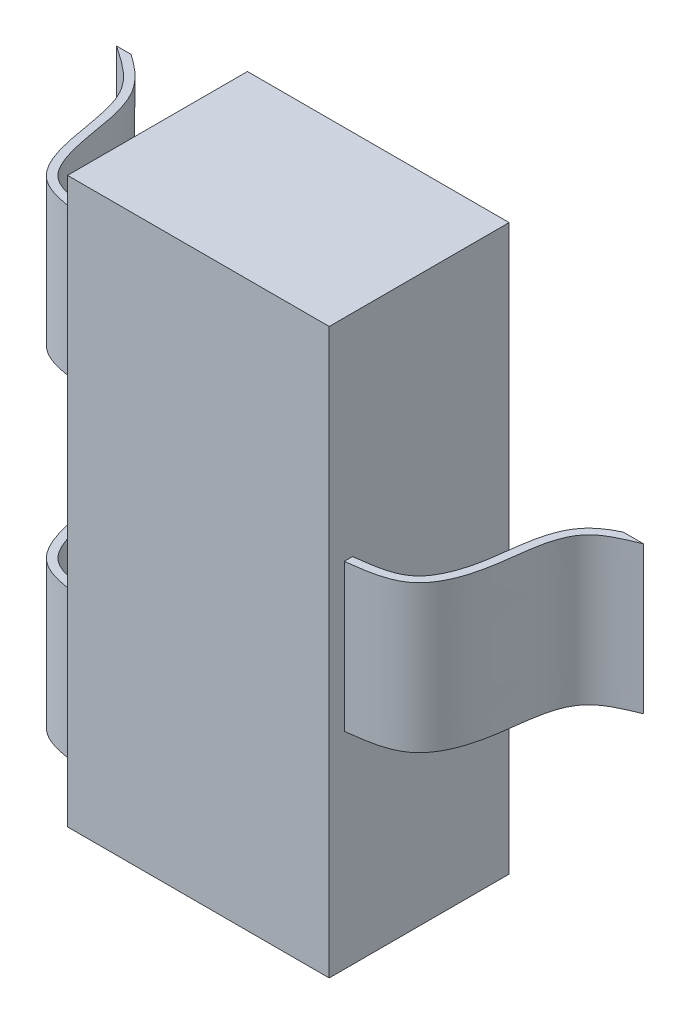
ISO-10303-21;
HEADER;
FILE_DESCRIPTION(('STEP AP214'),'2;1');
FILE_NAME('part.step','',(''),(''),'','','');
FILE_SCHEMA(('AUTOMOTIVE_DESIGN { 1 0 10303 214 1 1 1 1 }'));
ENDSEC;
DATA;
#1=APPLICATION_CONTEXT('core data for automotive mechanical design processes');
#2=APPLICATION_PROTOCOL_DEFINITION('international standard','automotive_design',2000,#1);
#3=PRODUCT_CONTEXT('',#1,'mechanical');
#4=PRODUCT('Part','Part','',(#3));
#5=PRODUCT_RELATED_PRODUCT_CATEGORY('part','',(#4));
#6=PRODUCT_DEFINITION_FORMATION('','',#4);
#7=PRODUCT_DEFINITION_CONTEXT('part definition',#1,'design');
#8=PRODUCT_DEFINITION('design','',#6,#7);
#9=PRODUCT_DEFINITION_SHAPE('','',#8);
#10=(LENGTH_UNIT() NAMED_UNIT(*) SI_UNIT(.MILLI.,.METRE.));
#11=(NAMED_UNIT(*) PLANE_ANGLE_UNIT() SI_UNIT($,.RADIAN.));
#12=(NAMED_UNIT(*) SI_UNIT($,.STERADIAN.) SOLID_ANGLE_UNIT());
#13=UNCERTAINTY_MEASURE_WITH_UNIT(LENGTH_MEASURE(1.E-05),#10,'distance_accuracy_value','');
#14=(GEOMETRIC_REPRESENTATION_CONTEXT(3) GLOBAL_UNCERTAINTY_ASSIGNED_CONTEXT((#13)) GLOBAL_UNIT_ASSIGNED_CONTEXT((#10,
#11,#12)) REPRESENTATION_CONTEXT('',''));
#15=CARTESIAN_POINT('',(0.,0.,0.));
#16=DIRECTION('',(0.,0.,1.));
#17=DIRECTION('',(1.,0.,0.));
#18=AXIS2_PLACEMENT_3D('',#15,#16,#17);
#19=CARTESIAN_POINT('',(-0.875,-1.71,0.));
#20=DIRECTION('',(0.,0.,1.));
#21=DIRECTION('',(1.,0.,0.));
#22=AXIS2_PLACEMENT_3D('',#19,#20,#21);
#23=PLANE('',#22);
#24=DIRECTION('',(-1.,0.,0.));
#25=VECTOR('',#24,1.);
#26=CARTESIAN_POINT('',(-0.875,-0.55,0.));
#27=LINE('',#26,#25);
#28=CARTESIAN_POINT('',(-1.58641629688414,-0.55,0.));
#29=VERTEX_POINT('',#28);
#30=CARTESIAN_POINT('',(-1.675,-0.55,0.));
#31=VERTEX_POINT('',#30);
#32=EDGE_CURVE('E172',#29,#31,#27,.T.);
#33=ORIENTED_EDGE('',*,*,#32,.F.);
#34=DIRECTION('',(0.,-1.,0.));
#35=VECTOR('',#34,1.);
#36=CARTESIAN_POINT('',(-1.58641629688414,1.74,0.));
#37=LINE('',#36,#35);
#38=CARTESIAN_POINT('',(-1.58641629688414,-1.45,0.));
#39=VERTEX_POINT('',#38);
#40=EDGE_CURVE('E156',#29,#39,#37,.T.);
#41=ORIENTED_EDGE('',*,*,#40,.T.);
#42=DIRECTION('',(1.,0.,0.));
#43=VECTOR('',#42,1.);
#44=CARTESIAN_POINT('',(-1.675,-1.45,0.));
#45=LINE('',#44,#43);
#46=CARTESIAN_POINT('',(-1.675,-1.45,0.));
#47=VERTEX_POINT('',#46);
#48=EDGE_CURVE('E171',#47,#39,#45,.T.);
#49=ORIENTED_EDGE('',*,*,#48,.F.);
#50=DIRECTION('',(0.,-1.,0.));
#51=VECTOR('',#50,1.);
#52=CARTESIAN_POINT('',(-1.675,-0.55,0.));
#53=LINE('',#52,#51);
#54=EDGE_CURVE('E179',#31,#47,#53,.T.);
#55=ORIENTED_EDGE('',*,*,#54,.F.);
#56=EDGE_LOOP('',(#33,#41,#49,#55));
#57=FACE_BOUND('',#56,.T.);
#58=ADVANCED_FACE('F36',(#57),#23,.F.);
#59=DIRECTION('',(-1.,0.,0.));
#60=VECTOR('',#59,1.);
#61=CARTESIAN_POINT('',(-0.875,1.475,0.));
#62=LINE('',#61,#60);
#63=CARTESIAN_POINT('',(-1.58641629688414,1.475,0.));
#64=VERTEX_POINT('',#63);
#65=CARTESIAN_POINT('',(-1.675,1.475,0.));
#66=VERTEX_POINT('',#65);
#67=EDGE_CURVE('E40',#64,#66,#62,.T.);
#68=ORIENTED_EDGE('',*,*,#67,.F.);
#69=CARTESIAN_POINT('',(-1.58641629688414,0.575,0.));
#70=VERTEX_POINT('',#69);
#71=EDGE_CURVE('E173',#64,#70,#37,.T.);
#72=ORIENTED_EDGE('',*,*,#71,.T.);
#73=DIRECTION('',(1.,0.,0.));
#74=VECTOR('',#73,1.);
#75=CARTESIAN_POINT('',(-1.675,0.575,0.));
#76=LINE('',#75,#74);
#77=CARTESIAN_POINT('',(-1.675,0.575000000000001,0.));
#78=VERTEX_POINT('',#77);
#79=EDGE_CURVE('E230',#78,#70,#76,.T.);
#80=ORIENTED_EDGE('',*,*,#79,.F.);
#81=DIRECTION('',(0.,-1.,0.));
#82=VECTOR('',#81,1.);
#83=CARTESIAN_POINT('',(-1.675,1.475,0.));
#84=LINE('',#83,#82);
#85=EDGE_CURVE('E228',#66,#78,#84,.T.);
#86=ORIENTED_EDGE('',*,*,#85,.F.);
#87=EDGE_LOOP('',(#68,#72,#80,#86));
#88=FACE_BOUND('',#87,.T.);
#89=ADVANCED_FACE('F300',(#88),#23,.F.);
#90=DIRECTION('',(1.,0.,0.));
#91=VECTOR('',#90,1.);
#92=CARTESIAN_POINT('',(-0.875,-1.71,0.));
#93=LINE('',#92,#91);
#94=CARTESIAN_POINT('',(-0.875,-1.71,0.));
#95=VERTEX_POINT('',#94);
#96=CARTESIAN_POINT('',(0.725,-1.71,0.));
#97=VERTEX_POINT('',#96);
#98=EDGE_CURVE('E259',#95,#97,#93,.T.);
#99=ORIENTED_EDGE('',*,*,#98,.F.);
#100=DIRECTION('',(0.,-1.,0.));
#101=VECTOR('',#100,1.);
#102=CARTESIAN_POINT('',(-0.875,0.575,0.));
#103=LINE('',#102,#101);
#104=CARTESIAN_POINT('',(-0.875,1.74,0.));
#105=VERTEX_POINT('',#104);
#106=EDGE_CURVE('E192',#105,#95,#103,.T.);
#107=ORIENTED_EDGE('',*,*,#106,.F.);
#108=DIRECTION('',(-1.,0.,0.));
#109=VECTOR('',#108,1.);
#110=CARTESIAN_POINT('',(0.725,1.74,0.));
#111=LINE('',#110,#109);
#112=CARTESIAN_POINT('',(0.725,1.74,0.));
#113=VERTEX_POINT('',#112);
#114=EDGE_CURVE('E283',#113,#105,#111,.T.);
#115=ORIENTED_EDGE('',*,*,#114,.F.);
#116=DIRECTION('',(0.,1.,0.));
#117=VECTOR('',#116,1.);
#118=CARTESIAN_POINT('',(0.725,0.45,0.));
#119=LINE('',#118,#117);
#120=EDGE_CURVE('E265',#97,#113,#119,.T.);
#121=ORIENTED_EDGE('',*,*,#120,.F.);
#122=EDGE_LOOP('',(#99,#107,#115,#121));
#123=FACE_BOUND('',#122,.T.);
#124=ADVANCED_FACE('F264',(#123),#23,.F.);
#125=CARTESIAN_POINT('',(-0.875,-1.71,1.1));
#126=DIRECTION('',(0.,1.,0.));
#127=DIRECTION('',(0.,0.,1.));
#128=AXIS2_PLACEMENT_3D('',#125,#126,#127);
#129=PLANE('',#128);
#130=ORIENTED_EDGE('',*,*,#98,.T.);
#131=DIRECTION('',(0.,0.,-1.));
#132=VECTOR('',#131,1.);
#133=CARTESIAN_POINT('',(0.725,-1.71,1.1));
#134=LINE('',#133,#132);
#135=CARTESIAN_POINT('',(0.725,-1.71,1.1));
#136=VERTEX_POINT('',#135);
#137=EDGE_CURVE('E249',#136,#97,#134,.T.);
#138=ORIENTED_EDGE('',*,*,#137,.F.);
#139=DIRECTION('',(1.,0.,0.));
#140=VECTOR('',#139,1.);
#141=CARTESIAN_POINT('',(-0.875,-1.71,1.1));
#142=LINE('',#141,#140);
#143=CARTESIAN_POINT('',(-0.875,-1.71,1.1));
#144=VERTEX_POINT('',#143);
#145=EDGE_CURVE('E181',#144,#136,#142,.T.);
#146=ORIENTED_EDGE('',*,*,#145,.F.);
#147=DIRECTION('',(0.,0.,-1.));
#148=VECTOR('',#147,1.);
#149=CARTESIAN_POINT('',(-0.875,-1.71,1.1));
#150=LINE('',#149,#148);
#151=EDGE_CURVE('E46',#144,#95,#150,.T.);
#152=ORIENTED_EDGE('',*,*,#151,.T.);
#153=EDGE_LOOP('',(#130,#138,#146,#152));
#154=FACE_BOUND('',#153,.T.);
#155=ADVANCED_FACE('F38',(#154),#129,.F.);
#156=CARTESIAN_POINT('',(0.725,-0.45,1.1));
#157=DIRECTION('',(0.,1.,0.));
#158=DIRECTION('',(0.,0.,1.));
#159=AXIS2_PLACEMENT_3D('',#156,#157,#158);
#160=PLANE('',#159);
#161=DIRECTION('',(0.,0.,-1.));
#162=VECTOR('',#161,1.);
#163=CARTESIAN_POINT('',(0.725,-0.45,1.1));
#164=LINE('',#163,#162);
#165=CARTESIAN_POINT('',(0.725,-0.449999999999999,1.00768400816071));
#166=VERTEX_POINT('',#165);
#167=CARTESIAN_POINT('',(0.724999999999962,-0.449999999999998,0.957298468849378));
#168=VERTEX_POINT('',#167);
#169=EDGE_CURVE('E243',#166,#168,#164,.T.);
#170=ORIENTED_EDGE('',*,*,#169,.T.);
#171=CARTESIAN_POINT('',(1.528622086414,-0.449999999999999,-0.0462992913405748));
#172=CARTESIAN_POINT('',(1.46986156604953,-0.449999999999999,-0.022340479151652));
#173=CARTESIAN_POINT('',(1.40845247297387,-0.449999999999999,0.00223861783664871));
#174=CARTESIAN_POINT('',(1.32736440376303,-0.449999999999999,0.0554605986947523));
#175=CARTESIAN_POINT('',(1.30188751089638,-0.449999999999999,0.0765675974779763));
#176=CARTESIAN_POINT('',(1.25991048910309,-0.449999999999999,0.125534473454191));
#177=CARTESIAN_POINT('',(1.24339485454769,-0.449999999999999,0.152637932673938));
#178=CARTESIAN_POINT('',(1.17761069445625,-0.449999999999999,0.294933575013133));
#179=CARTESIAN_POINT('',(1.17427129447097,-0.449999999999999,0.42968310509716));
#180=CARTESIAN_POINT('',(1.13407982124533,-0.449999999999999,0.680245939024234));
#181=CARTESIAN_POINT('',(1.09363357899894,-0.449999999999999,0.798176416242423));
#182=CARTESIAN_POINT('',(0.992225356223103,-0.449999999999999,0.893756480555563));
#183=CARTESIAN_POINT('',(0.949632551680684,-0.449999999999999,0.913640338616297));
#184=CARTESIAN_POINT('',(0.843728829002255,-0.449999999999999,0.942335491885586));
#185=CARTESIAN_POINT('',(0.78232096922687,-0.449999999999999,0.950175780395145));
#186=CARTESIAN_POINT('',(0.718833656360517,-0.449999999999999,0.958065703009088));
#187=B_SPLINE_CURVE_WITH_KNOTS('',3,(#171,#172,#173,#174,#175,#176,#177,#178,#179,#180,#181,
#182,#183,#184,#185,#186),.UNSPECIFIED.,.F.,.F.,(4,2,2,2,2,2,2,4),(0.,0.125,0.1875,0.25,0.5,
0.750000000000001,0.875,1.),.UNSPECIFIED.);
#188=CARTESIAN_POINT('',(1.42157256783221,-0.449999999999998,0.));
#189=VERTEX_POINT('',#188);
#190=EDGE_CURVE('E625',#168,#189,#187,.F.);
#191=ORIENTED_EDGE('',*,*,#190,.T.);
#192=DIRECTION('',(1.,0.,0.));
#193=VECTOR('',#192,1.);
#194=CARTESIAN_POINT('',(0.725,-0.45,0.));
#195=LINE('',#194,#193);
#196=CARTESIAN_POINT('',(1.5475,-0.45,0.));
#197=VERTEX_POINT('',#196);
#198=EDGE_CURVE('E266',#189,#197,#195,.T.);
#199=ORIENTED_EDGE('',*,*,#198,.T.);
#200=CARTESIAN_POINT('',(0.725,-0.449999999999999,1.00768400816071));
#201=CARTESIAN_POINT('',(0.841255765887461,-0.449999999999999,0.993236255454474));
#202=CARTESIAN_POINT('',(1.07443441938041,-0.449999999999999,0.964257843103717));
#203=CARTESIAN_POINT('',(1.24069724731398,-0.449999999999999,0.566279230900491));
#204=CARTESIAN_POINT('',(1.212102737147,-0.449999999999999,0.136753724771851));
#205=CARTESIAN_POINT('',(1.46636899253886,-0.449999999999999,0.0330800775487122));
#206=CARTESIAN_POINT('',(1.5475,-0.449999999999999,0.));
#207=B_SPLINE_CURVE_WITH_KNOTS('',3,(#200,#201,#202,#203,#204,#205,#206),.UNSPECIFIED.,.F.,.F.,
(4,1,1,1,4),(0.,0.228895665603673,0.459104825368433,0.827411740574484,1.),.UNSPECIFIED.);
#208=EDGE_CURVE('E648',#197,#166,#207,.F.);
#209=ORIENTED_EDGE('',*,*,#208,.T.);
#210=EDGE_LOOP('',(#170,#191,#199,#209));
#211=FACE_BOUND('',#210,.T.);
#212=ADVANCED_FACE('F374',(#211),#160,.F.);
#213=CARTESIAN_POINT('',(1.5475,0.45,1.1));
#214=DIRECTION('',(0.,-1.,0.));
#215=DIRECTION('',(0.,0.,-1.));
#216=AXIS2_PLACEMENT_3D('',#213,#214,#215);
#217=PLANE('',#216);
#218=DIRECTION('',(-1.,0.,0.));
#219=VECTOR('',#218,1.);
#220=CARTESIAN_POINT('',(1.5475,0.45,0.));
#221=LINE('',#220,#219);
#222=CARTESIAN_POINT('',(1.5475,0.450000000000001,0.));
#223=VERTEX_POINT('',#222);
#224=CARTESIAN_POINT('',(1.42157256783223,0.45,0.));
#225=VERTEX_POINT('',#224);
#226=EDGE_CURVE('E280',#223,#225,#221,.T.);
#227=ORIENTED_EDGE('',*,*,#226,.T.);
#228=CARTESIAN_POINT('',(1.528622086414,0.450000000000001,-0.0462992913405748));
#229=CARTESIAN_POINT('',(1.46986156604953,0.450000000000001,-0.022340479151652));
#230=CARTESIAN_POINT('',(1.40845247297387,0.450000000000001,0.00223861783664871));
#231=CARTESIAN_POINT('',(1.32736440376303,0.450000000000001,0.0554605986947523));
#232=CARTESIAN_POINT('',(1.30188751089638,0.450000000000001,0.0765675974779763));
#233=CARTESIAN_POINT('',(1.25991048910309,0.450000000000001,0.125534473454191));
#234=CARTESIAN_POINT('',(1.24339485454769,0.450000000000001,0.152637932673938));
#235=CARTESIAN_POINT('',(1.17761069445625,0.450000000000001,0.294933575013133));
#236=CARTESIAN_POINT('',(1.17427129447097,0.450000000000001,0.42968310509716));
#237=CARTESIAN_POINT('',(1.13407982124533,0.450000000000001,0.680245939024234));
#238=CARTESIAN_POINT('',(1.09363357899894,0.450000000000001,0.798176416242423));
#239=CARTESIAN_POINT('',(0.992225356223103,0.450000000000001,0.893756480555563));
#240=CARTESIAN_POINT('',(0.949632551680684,0.450000000000001,0.913640338616297));
#241=CARTESIAN_POINT('',(0.843728829002255,0.450000000000001,0.942335491885586));
#242=CARTESIAN_POINT('',(0.78232096922687,0.450000000000001,0.950175780395145));
#243=CARTESIAN_POINT('',(0.718833656360517,0.450000000000001,0.958065703009088));
#244=B_SPLINE_CURVE_WITH_KNOTS('',3,(#228,#229,#230,#231,#232,#233,#234,#235,#236,#237,#238,
#239,#240,#241,#242,#243),.UNSPECIFIED.,.F.,.F.,(4,2,2,2,2,2,2,4),(0.,0.125,0.1875,0.25,0.5,
0.750000000000001,0.875,1.),.UNSPECIFIED.);
#245=CARTESIAN_POINT('',(0.724999999999962,0.450000000000001,0.957298468849378));
#246=VERTEX_POINT('',#245);
#247=EDGE_CURVE('E54',#225,#246,#244,.T.);
#248=ORIENTED_EDGE('',*,*,#247,.T.);
#249=DIRECTION('',(0.,0.,-1.));
#250=VECTOR('',#249,1.);
#251=CARTESIAN_POINT('',(0.725,0.45,1.1));
#252=LINE('',#251,#250);
#253=CARTESIAN_POINT('',(0.725,0.450000000000001,1.00768400816071));
#254=VERTEX_POINT('',#253);
#255=EDGE_CURVE('E236',#254,#246,#252,.T.);
#256=ORIENTED_EDGE('',*,*,#255,.F.);
#257=CARTESIAN_POINT('',(0.725,0.450000000000001,1.00768400816071));
#258=CARTESIAN_POINT('',(0.841255765887461,0.450000000000001,0.993236255454474));
#259=CARTESIAN_POINT('',(1.07443441938041,0.450000000000001,0.964257843103717));
#260=CARTESIAN_POINT('',(1.24069724731398,0.450000000000001,0.566279230900491));
#261=CARTESIAN_POINT('',(1.212102737147,0.450000000000001,0.136753724771851));
#262=CARTESIAN_POINT('',(1.46636899253886,0.450000000000001,0.0330800775487122));
#263=CARTESIAN_POINT('',(1.5475,0.450000000000001,0.));
#264=B_SPLINE_CURVE_WITH_KNOTS('',3,(#257,#258,#259,#260,#261,#262,#263),.UNSPECIFIED.,.F.,.F.,
(4,1,1,1,4),(0.,0.228895665603673,0.459104825368433,0.827411740574484,1.),.UNSPECIFIED.);
#265=EDGE_CURVE('E644',#254,#223,#264,.T.);
#266=ORIENTED_EDGE('',*,*,#265,.T.);
#267=EDGE_LOOP('',(#227,#248,#256,#266));
#268=FACE_BOUND('',#267,.T.);
#269=ADVANCED_FACE('F372',(#268),#217,.F.);
#270=CARTESIAN_POINT('',(0.725,0.45,1.1));
#271=DIRECTION('',(-1.,0.,0.));
#272=DIRECTION('',(0.,0.,1.));
#273=AXIS2_PLACEMENT_3D('',#270,#271,#272);
#274=PLANE('',#273);
#275=DIRECTION('',(0.,-1.,0.));
#276=VECTOR('',#275,1.);
#277=CARTESIAN_POINT('',(0.724999999999962,1.74,0.957298468849378));
#278=LINE('',#277,#276);
#279=EDGE_CURVE('E608',#246,#168,#278,.T.);
#280=ORIENTED_EDGE('',*,*,#279,.T.);
#281=ORIENTED_EDGE('',*,*,#169,.F.);
#282=DIRECTION('',(0.,-1.,0.));
#283=VECTOR('',#282,1.);
#284=CARTESIAN_POINT('',(0.725,1.74,1.00768400816071));
#285=LINE('',#284,#283);
#286=EDGE_CURVE('E632',#254,#166,#285,.T.);
#287=ORIENTED_EDGE('',*,*,#286,.F.);
#288=ORIENTED_EDGE('',*,*,#255,.T.);
#289=EDGE_LOOP('',(#280,#281,#287,#288));
#290=FACE_BOUND('',#289,.T.);
#291=ORIENTED_EDGE('',*,*,#137,.T.);
#292=ORIENTED_EDGE('',*,*,#120,.T.);
#293=DIRECTION('',(0.,0.,-1.));
#294=VECTOR('',#293,1.);
#295=CARTESIAN_POINT('',(0.725,1.74,1.1));
#296=LINE('',#295,#294);
#297=CARTESIAN_POINT('',(0.725,1.74,1.1));
#298=VERTEX_POINT('',#297);
#299=EDGE_CURVE('E216',#298,#113,#296,.T.);
#300=ORIENTED_EDGE('',*,*,#299,.F.);
#301=DIRECTION('',(0.,1.,0.));
#302=VECTOR('',#301,1.);
#303=CARTESIAN_POINT('',(0.725,-1.71,1.1));
#304=LINE('',#303,#302);
#305=EDGE_CURVE('E196',#136,#298,#304,.T.);
#306=ORIENTED_EDGE('',*,*,#305,.F.);
#307=EDGE_LOOP('',(#291,#292,#300,#306));
#308=FACE_BOUND('',#307,.T.);
#309=ADVANCED_FACE('F369',(#290,#308),#274,.F.);
#310=CARTESIAN_POINT('',(0.725,1.74,1.1));
#311=DIRECTION('',(0.,-1.,0.));
#312=DIRECTION('',(0.,0.,-1.));
#313=AXIS2_PLACEMENT_3D('',#310,#311,#312);
#314=PLANE('',#313);
#315=ORIENTED_EDGE('',*,*,#114,.T.);
#316=DIRECTION('',(0.,0.,-1.));
#317=VECTOR('',#316,1.);
#318=CARTESIAN_POINT('',(-0.875,1.74,1.1));
#319=LINE('',#318,#317);
#320=CARTESIAN_POINT('',(-0.875,1.74,1.1));
#321=VERTEX_POINT('',#320);
#322=EDGE_CURVE('E210',#321,#105,#319,.T.);
#323=ORIENTED_EDGE('',*,*,#322,.F.);
#324=DIRECTION('',(-1.,0.,0.));
#325=VECTOR('',#324,1.);
#326=CARTESIAN_POINT('',(0.725,1.74,1.1));
#327=LINE('',#326,#325);
#328=EDGE_CURVE('E198',#298,#321,#327,.T.);
#329=ORIENTED_EDGE('',*,*,#328,.F.);
#330=ORIENTED_EDGE('',*,*,#299,.T.);
#331=EDGE_LOOP('',(#315,#323,#329,#330));
#332=FACE_BOUND('',#331,.T.);
#333=ADVANCED_FACE('F366',(#332),#314,.F.);
#334=CARTESIAN_POINT('',(-0.875,1.475,1.1));
#335=DIRECTION('',(0.,-1.,0.));
#336=DIRECTION('',(0.,0.,-1.));
#337=AXIS2_PLACEMENT_3D('',#334,#335,#336);
#338=PLANE('',#337);
#339=DIRECTION('',(0.,0.,-1.));
#340=VECTOR('',#339,1.);
#341=CARTESIAN_POINT('',(-0.875,1.475,1.1));
#342=LINE('',#341,#340);
#343=CARTESIAN_POINT('',(-0.875,1.475,1.00768400816071));
#344=VERTEX_POINT('',#343);
#345=CARTESIAN_POINT('',(-0.875,1.475,0.957331047558212));
#346=VERTEX_POINT('',#345);
#347=EDGE_CURVE('E207',#344,#346,#342,.T.);
#348=ORIENTED_EDGE('',*,*,#347,.T.);
#349=CARTESIAN_POINT('',(-0.869097345858551,1.475,0.958033643871149));
#350=CARTESIAN_POINT('',(-0.932182641591151,1.475,0.950533785865096));
#351=CARTESIAN_POINT('',(-0.993236046552863,1.475,0.943055289876106));
#352=CARTESIAN_POINT('',(-1.0968499854981,1.475,0.915474597659181));
#353=CARTESIAN_POINT('',(-1.13724948207356,1.475,0.896473216285613));
#354=CARTESIAN_POINT('',(-1.22798014052741,1.475,0.806351911691375));
#355=CARTESIAN_POINT('',(-1.26060780072644,1.475,0.687731730688972));
#356=CARTESIAN_POINT('',(-1.30487837310532,1.475,0.443026409749142));
#357=CARTESIAN_POINT('',(-1.31780752404798,1.475,0.317989624554231));
#358=CARTESIAN_POINT('',(-1.40699886914686,1.475,0.155193673456342));
#359=CARTESIAN_POINT('',(-1.44996041579085,1.475,0.108153897535241));
#360=CARTESIAN_POINT('',(-1.54451766346915,1.475,0.0277098092491826));
#361=CARTESIAN_POINT('',(-1.59649045234312,1.475,-0.00727989477187243));
#362=CARTESIAN_POINT('',(-1.64699774807927,1.475,-0.0414231081326353));
#363=B_SPLINE_CURVE_WITH_KNOTS('',3,(#349,#350,#351,#352,#353,#354,#355,#356,#357,#358,#359,
#360,#361,#362),.UNSPECIFIED.,.F.,.F.,(4,2,2,2,2,2,4),(0.,0.125,0.25,0.5,0.75,0.875,1.),.UNSPECIFIED.);
#364=EDGE_CURVE('E290',#346,#64,#363,.T.);
#365=ORIENTED_EDGE('',*,*,#364,.T.);
#366=ORIENTED_EDGE('',*,*,#67,.T.);
#367=CARTESIAN_POINT('',(-1.675,1.475,0.));
#368=CARTESIAN_POINT('',(-1.58471561280788,1.475,0.0610327488359233));
#369=CARTESIAN_POINT('',(-1.38446923460138,1.475,0.196400416341646));
#370=CARTESIAN_POINT('',(-1.34241555472493,1.475,0.561893230487516));
#371=CARTESIAN_POINT('',(-1.2470708235171,1.475,0.963450588753418));
#372=CARTESIAN_POINT('',(-0.99250285804969,1.475,0.993714750500205));
#373=CARTESIAN_POINT('',(-0.875,1.475,1.00768400816071));
#374=B_SPLINE_CURVE_WITH_KNOTS('',3,(#367,#368,#369,#370,#371,#372,#373),.UNSPECIFIED.,.F.,.F.,
(4,1,1,1,4),(0.,0.22344392497215,0.495587754422108,0.767174631019105,1.),.UNSPECIFIED.);
#375=EDGE_CURVE('E267',#66,#344,#374,.T.);
#376=ORIENTED_EDGE('',*,*,#375,.T.);
#377=EDGE_LOOP('',(#348,#365,#366,#376));
#378=FACE_BOUND('',#377,.T.);
#379=ADVANCED_FACE('F288',(#378),#338,.F.);
#380=CARTESIAN_POINT('',(-1.675,0.575,1.1));
#381=DIRECTION('',(0.,1.,0.));
#382=DIRECTION('',(0.,0.,1.));
#383=AXIS2_PLACEMENT_3D('',#380,#381,#382);
#384=PLANE('',#383);
#385=ORIENTED_EDGE('',*,*,#79,.T.);
#386=CARTESIAN_POINT('',(-0.869097345858551,0.575,0.958033643871149));
#387=CARTESIAN_POINT('',(-0.932182641591151,0.575,0.950533785865096));
#388=CARTESIAN_POINT('',(-0.993236046552863,0.575,0.943055289876106));
#389=CARTESIAN_POINT('',(-1.0968499854981,0.575,0.915474597659181));
#390=CARTESIAN_POINT('',(-1.13724948207356,0.575,0.896473216285613));
#391=CARTESIAN_POINT('',(-1.22798014052741,0.575,0.806351911691375));
#392=CARTESIAN_POINT('',(-1.26060780072644,0.575,0.687731730688972));
#393=CARTESIAN_POINT('',(-1.30487837310532,0.575,0.443026409749142));
#394=CARTESIAN_POINT('',(-1.31780752404798,0.575,0.317989624554231));
#395=CARTESIAN_POINT('',(-1.40699886914686,0.575,0.155193673456342));
#396=CARTESIAN_POINT('',(-1.44996041579085,0.575,0.108153897535241));
#397=CARTESIAN_POINT('',(-1.54451766346915,0.575,0.0277098092491826));
#398=CARTESIAN_POINT('',(-1.59649045234312,0.575,-0.00727989477187243));
#399=CARTESIAN_POINT('',(-1.64699774807927,0.575,-0.0414231081326353));
#400=B_SPLINE_CURVE_WITH_KNOTS('',3,(#386,#387,#388,#389,#390,#391,#392,#393,#394,#395,#396,
#397,#398,#399),.UNSPECIFIED.,.F.,.F.,(4,2,2,2,2,2,4),(0.,0.125,0.25,0.5,0.75,0.875,1.),.UNSPECIFIED.);
#401=CARTESIAN_POINT('',(-0.875,0.575000000000001,0.957331047558212));
#402=VERTEX_POINT('',#401);
#403=EDGE_CURVE('E305',#70,#402,#400,.F.);
#404=ORIENTED_EDGE('',*,*,#403,.T.);
#405=DIRECTION('',(0.,0.,-1.));
#406=VECTOR('',#405,1.);
#407=CARTESIAN_POINT('',(-0.875,0.575,1.1));
#408=LINE('',#407,#406);
#409=CARTESIAN_POINT('',(-0.875,0.575000000000001,1.00768400816071));
#410=VERTEX_POINT('',#409);
#411=EDGE_CURVE('E204',#410,#402,#408,.T.);
#412=ORIENTED_EDGE('',*,*,#411,.F.);
#413=CARTESIAN_POINT('',(-1.675,0.575,0.));
#414=CARTESIAN_POINT('',(-1.58471561280788,0.575,0.0610327488359233));
#415=CARTESIAN_POINT('',(-1.38446923460138,0.575,0.196400416341646));
#416=CARTESIAN_POINT('',(-1.34241555472493,0.575,0.561893230487516));
#417=CARTESIAN_POINT('',(-1.2470708235171,0.575,0.963450588753418));
#418=CARTESIAN_POINT('',(-0.99250285804969,0.575,0.993714750500205));
#419=CARTESIAN_POINT('',(-0.875,0.575,1.00768400816071));
#420=B_SPLINE_CURVE_WITH_KNOTS('',3,(#413,#414,#415,#416,#417,#418,#419),.UNSPECIFIED.,.F.,.F.,
(4,1,1,1,4),(0.,0.22344392497215,0.495587754422108,0.767174631019105,1.),.UNSPECIFIED.);
#421=EDGE_CURVE('E272',#410,#78,#420,.F.);
#422=ORIENTED_EDGE('',*,*,#421,.T.);
#423=EDGE_LOOP('',(#385,#404,#412,#422));
#424=FACE_BOUND('',#423,.T.);
#425=ADVANCED_FACE('F303',(#424),#384,.F.);
#426=CARTESIAN_POINT('',(-0.875,0.575,1.1));
#427=DIRECTION('',(1.,0.,0.));
#428=DIRECTION('',(0.,0.,-1.));
#429=AXIS2_PLACEMENT_3D('',#426,#427,#428);
#430=PLANE('',#429);
#431=DIRECTION('',(0.,-1.,0.));
#432=VECTOR('',#431,1.);
#433=CARTESIAN_POINT('',(-0.875,1.74,0.957331047558212));
#434=LINE('',#433,#432);
#435=EDGE_CURVE('E583',#346,#402,#434,.T.);
#436=ORIENTED_EDGE('',*,*,#435,.F.);
#437=ORIENTED_EDGE('',*,*,#347,.F.);
#438=DIRECTION('',(0.,-1.,0.));
#439=VECTOR('',#438,1.);
#440=CARTESIAN_POINT('',(-0.875,1.74,1.00768400816071));
#441=LINE('',#440,#439);
#442=EDGE_CURVE('E298',#344,#410,#441,.T.);
#443=ORIENTED_EDGE('',*,*,#442,.T.);
#444=ORIENTED_EDGE('',*,*,#411,.T.);
#445=EDGE_LOOP('',(#436,#437,#443,#444));
#446=FACE_BOUND('',#445,.T.);
#447=CARTESIAN_POINT('',(-0.875,-0.55,0.957331047558212));
#448=VERTEX_POINT('',#447);
#449=CARTESIAN_POINT('',(-0.875,-1.45,0.957331047558212));
#450=VERTEX_POINT('',#449);
#451=EDGE_CURVE('E159',#448,#450,#434,.T.);
#452=ORIENTED_EDGE('',*,*,#451,.F.);
#453=DIRECTION('',(0.,0.,-1.));
#454=VECTOR('',#453,1.);
#455=CARTESIAN_POINT('',(-0.875,-0.55,1.1));
#456=LINE('',#455,#454);
#457=CARTESIAN_POINT('',(-0.875,-0.549999999999999,1.00768400816071));
#458=VERTEX_POINT('',#457);
#459=EDGE_CURVE('E201',#458,#448,#456,.T.);
#460=ORIENTED_EDGE('',*,*,#459,.F.);
#461=CARTESIAN_POINT('',(-0.875,-1.45,1.00768400816071));
#462=VERTEX_POINT('',#461);
#463=EDGE_CURVE('E325',#458,#462,#441,.T.);
#464=ORIENTED_EDGE('',*,*,#463,.T.);
#465=DIRECTION('',(0.,0.,-1.));
#466=VECTOR('',#465,1.);
#467=CARTESIAN_POINT('',(-0.875,-1.45,1.1));
#468=LINE('',#467,#466);
#469=EDGE_CURVE('E186',#462,#450,#468,.T.);
#470=ORIENTED_EDGE('',*,*,#469,.T.);
#471=EDGE_LOOP('',(#452,#460,#464,#470));
#472=FACE_BOUND('',#471,.T.);
#473=ORIENTED_EDGE('',*,*,#322,.T.);
#474=ORIENTED_EDGE('',*,*,#106,.T.);
#475=ORIENTED_EDGE('',*,*,#151,.F.);
#476=DIRECTION('',(0.,-1.,0.));
#477=VECTOR('',#476,1.);
#478=CARTESIAN_POINT('',(-0.875,-1.45,1.1));
#479=LINE('',#478,#477);
#480=EDGE_CURVE('E61',#321,#144,#479,.T.);
#481=ORIENTED_EDGE('',*,*,#480,.F.);
#482=EDGE_LOOP('',(#473,#474,#475,#481));
#483=FACE_BOUND('',#482,.T.);
#484=ADVANCED_FACE('F260',(#446,#472,#483),#430,.F.);
#485=CARTESIAN_POINT('',(-0.875,-0.55,1.1));
#486=DIRECTION('',(0.,-1.,0.));
#487=DIRECTION('',(0.,0.,-1.));
#488=AXIS2_PLACEMENT_3D('',#485,#486,#487);
#489=PLANE('',#488);
#490=ORIENTED_EDGE('',*,*,#459,.T.);
#491=CARTESIAN_POINT('',(-0.869097345858551,-0.549999999999999,0.958033643871149));
#492=CARTESIAN_POINT('',(-0.932182641591151,-0.549999999999999,0.950533785865096));
#493=CARTESIAN_POINT('',(-0.993236046552863,-0.549999999999999,0.943055289876106));
#494=CARTESIAN_POINT('',(-1.0968499854981,-0.549999999999999,0.915474597659181));
#495=CARTESIAN_POINT('',(-1.13724948207356,-0.549999999999999,0.896473216285613));
#496=CARTESIAN_POINT('',(-1.22798014052741,-0.549999999999999,0.806351911691375));
#497=CARTESIAN_POINT('',(-1.26060780072644,-0.549999999999999,0.687731730688972));
#498=CARTESIAN_POINT('',(-1.30487837310532,-0.549999999999999,0.443026409749142));
#499=CARTESIAN_POINT('',(-1.31780752404798,-0.549999999999999,0.317989624554231));
#500=CARTESIAN_POINT('',(-1.40699886914686,-0.549999999999999,0.155193673456342));
#501=CARTESIAN_POINT('',(-1.44996041579085,-0.549999999999999,0.108153897535241));
#502=CARTESIAN_POINT('',(-1.54451766346915,-0.549999999999999,0.0277098092491826));
#503=CARTESIAN_POINT('',(-1.59649045234312,-0.549999999999999,-0.00727989477187243));
#504=CARTESIAN_POINT('',(-1.64699774807927,-0.549999999999999,-0.0414231081326353));
#505=B_SPLINE_CURVE_WITH_KNOTS('',3,(#491,#492,#493,#494,#495,#496,#497,#498,#499,#500,#501,
#502,#503,#504),.UNSPECIFIED.,.F.,.F.,(4,2,2,2,2,2,4),(0.,0.125,0.25,0.5,0.75,0.875,1.),.UNSPECIFIED.);
#506=EDGE_CURVE('E584',#448,#29,#505,.T.);
#507=ORIENTED_EDGE('',*,*,#506,.T.);
#508=ORIENTED_EDGE('',*,*,#32,.T.);
#509=CARTESIAN_POINT('',(-1.675,-0.549999999999999,0.));
#510=CARTESIAN_POINT('',(-1.58471561280788,-0.549999999999999,0.0610327488359233));
#511=CARTESIAN_POINT('',(-1.38446923460138,-0.549999999999999,0.196400416341646));
#512=CARTESIAN_POINT('',(-1.34241555472493,-0.549999999999999,0.561893230487516));
#513=CARTESIAN_POINT('',(-1.2470708235171,-0.549999999999999,0.963450588753418));
#514=CARTESIAN_POINT('',(-0.99250285804969,-0.549999999999999,0.993714750500205));
#515=CARTESIAN_POINT('',(-0.875,-0.549999999999999,1.00768400816071));
#516=B_SPLINE_CURVE_WITH_KNOTS('',3,(#509,#510,#511,#512,#513,#514,#515),.UNSPECIFIED.,.F.,.F.,
(4,1,1,1,4),(0.,0.22344392497215,0.495587754422108,0.767174631019105,1.),.UNSPECIFIED.);
#517=EDGE_CURVE('E306',#31,#458,#516,.T.);
#518=ORIENTED_EDGE('',*,*,#517,.T.);
#519=EDGE_LOOP('',(#490,#507,#508,#518));
#520=FACE_BOUND('',#519,.T.);
#521=ADVANCED_FACE('F355',(#520),#489,.F.);
#522=CARTESIAN_POINT('',(-1.675,-1.45,1.1));
#523=DIRECTION('',(0.,1.,0.));
#524=DIRECTION('',(0.,0.,1.));
#525=AXIS2_PLACEMENT_3D('',#522,#523,#524);
#526=PLANE('',#525);
#527=ORIENTED_EDGE('',*,*,#48,.T.);
#528=CARTESIAN_POINT('',(-0.875,-1.45,0.957331047558212));
#529=CARTESIAN_POINT('',(-0.935985962274952,-1.45,0.950060656470978));
#530=CARTESIAN_POINT('',(-0.994853527694808,-1.45,0.942624737288329));
#531=CARTESIAN_POINT('',(-1.0968499854981,-1.45,0.915474597659181));
#532=CARTESIAN_POINT('',(-1.13724948207356,-1.45,0.896473216285613));
#533=CARTESIAN_POINT('',(-1.22798014052741,-1.45,0.806351911691375));
#534=CARTESIAN_POINT('',(-1.26060780072644,-1.45,0.687731730688972));
#535=CARTESIAN_POINT('',(-1.30487837310532,-1.45,0.443026409749142));
#536=CARTESIAN_POINT('',(-1.31780752404798,-1.45,0.317989624554231));
#537=CARTESIAN_POINT('',(-1.40699886914686,-1.45,0.155193673456342));
#538=CARTESIAN_POINT('',(-1.44996041579085,-1.45,0.108153897535241));
#539=CARTESIAN_POINT('',(-1.52571082574989,-1.45,0.0437096289458928));
#540=CARTESIAN_POINT('',(-1.55588499820922,-1.45,0.0213849654674761));
#541=CARTESIAN_POINT('',(-1.58641629688401,-1.45,0.));
#542=B_SPLINE_CURVE_WITH_KNOTS('',3,(#528,#529,#530,#531,#532,#533,#534,#535,#536,#537,#538,
#539,#540,#541),.UNSPECIFIED.,.F.,.F.,(4,2,2,2,2,2,4),(0.0039026629969159,0.125,0.25,0.5,0.75,
0.875,0.95027658328411),.UNSPECIFIED.);
#543=EDGE_CURVE('E152',#450,#39,#542,.T.);
#544=ORIENTED_EDGE('',*,*,#543,.F.);
#545=ORIENTED_EDGE('',*,*,#469,.F.);
#546=CARTESIAN_POINT('',(-1.675,-1.45,0.));
#547=CARTESIAN_POINT('',(-1.58471561280788,-1.45,0.0610327488359233));
#548=CARTESIAN_POINT('',(-1.38446923460138,-1.45,0.196400416341646));
#549=CARTESIAN_POINT('',(-1.34241555472493,-1.45,0.561893230487516));
#550=CARTESIAN_POINT('',(-1.2470708235171,-1.45,0.963450588753418));
#551=CARTESIAN_POINT('',(-0.99250285804969,-1.45,0.993714750500205));
#552=CARTESIAN_POINT('',(-0.875,-1.45,1.00768400816071));
#553=B_SPLINE_CURVE_WITH_KNOTS('',3,(#546,#547,#548,#549,#550,#551,#552),.UNSPECIFIED.,.F.,.F.,
(4,1,1,1,4),(0.,0.22344392497215,0.495587754422108,0.767174631019105,1.),.UNSPECIFIED.);
#554=EDGE_CURVE('E178',#47,#462,#553,.T.);
#555=ORIENTED_EDGE('',*,*,#554,.F.);
#556=EDGE_LOOP('',(#527,#544,#545,#555));
#557=FACE_BOUND('',#556,.T.);
#558=ADVANCED_FACE('F176',(#557),#526,.F.);
#559=CARTESIAN_POINT('',(-0.875,-1.71,1.1));
#560=DIRECTION('',(0.,0.,1.));
#561=DIRECTION('',(1.,0.,0.));
#562=AXIS2_PLACEMENT_3D('',#559,#560,#561);
#563=PLANE('',#562);
#564=ORIENTED_EDGE('',*,*,#305,.T.);
#565=ORIENTED_EDGE('',*,*,#328,.T.);
#566=ORIENTED_EDGE('',*,*,#480,.T.);
#567=ORIENTED_EDGE('',*,*,#145,.T.);
#568=EDGE_LOOP('',(#564,#565,#566,#567));
#569=FACE_BOUND('',#568,.T.);
#570=ADVANCED_FACE('F348',(#569),#563,.T.);
#571=ORIENTED_EDGE('',*,*,#198,.F.);
#572=DIRECTION('',(0.,-1.,0.));
#573=VECTOR('',#572,1.);
#574=CARTESIAN_POINT('',(1.42157256783223,1.74,0.));
#575=LINE('',#574,#573);
#576=EDGE_CURVE('E11',#189,#225,#575,.F.);
#577=ORIENTED_EDGE('',*,*,#576,.T.);
#578=ORIENTED_EDGE('',*,*,#226,.F.);
#579=DIRECTION('',(0.,1.,0.));
#580=VECTOR('',#579,1.);
#581=CARTESIAN_POINT('',(1.5475,-0.45,0.));
#582=LINE('',#581,#580);
#583=EDGE_CURVE('E269',#197,#223,#582,.T.);
#584=ORIENTED_EDGE('',*,*,#583,.F.);
#585=EDGE_LOOP('',(#571,#577,#578,#584));
#586=FACE_BOUND('',#585,.T.);
#587=ADVANCED_FACE('F345',(#586),#23,.F.);
#588=CARTESIAN_POINT('',(-1.675,1.74,0.));
#589=CARTESIAN_POINT('',(-1.58471561280788,1.74,0.0610327488359233));
#590=CARTESIAN_POINT('',(-1.38446923460138,1.74,0.196400416341646));
#591=CARTESIAN_POINT('',(-1.34241555472493,1.74,0.561893230487516));
#592=CARTESIAN_POINT('',(-1.2470708235171,1.74,0.963450588753418));
#593=CARTESIAN_POINT('',(-0.99250285804969,1.74,0.993714750500205));
#594=CARTESIAN_POINT('',(-0.875,1.74,1.00768400816071));
#595=B_SPLINE_CURVE_WITH_KNOTS('',3,(#588,#589,#590,#591,#592,#593,#594),.UNSPECIFIED.,.F.,.F.,
(4,1,1,1,4),(0.,0.22344392497215,0.495587754422108,0.767174631019105,1.),.UNSPECIFIED.);
#596=DIRECTION('',(0.,-1.,0.));
#597=VECTOR('',#596,1.);
#598=SURFACE_OF_LINEAR_EXTRUSION('',#595,#597);
#599=ORIENTED_EDGE('',*,*,#54,.T.);
#600=ORIENTED_EDGE('',*,*,#554,.T.);
#601=ORIENTED_EDGE('',*,*,#463,.F.);
#602=ORIENTED_EDGE('',*,*,#517,.F.);
#603=EDGE_LOOP('',(#599,#600,#601,#602));
#604=FACE_BOUND('',#603,.T.);
#605=ADVANCED_FACE('F342',(#604),#598,.F.);
#606=ORIENTED_EDGE('',*,*,#85,.T.);
#607=ORIENTED_EDGE('',*,*,#421,.F.);
#608=ORIENTED_EDGE('',*,*,#442,.F.);
#609=ORIENTED_EDGE('',*,*,#375,.F.);
#610=EDGE_LOOP('',(#606,#607,#608,#609));
#611=FACE_BOUND('',#610,.T.);
#612=ADVANCED_FACE('F295',(#611),#598,.F.);
#613=CARTESIAN_POINT('',(0.725,1.74,1.00768400816071));
#614=CARTESIAN_POINT('',(0.841255765887461,1.74,0.993236255454474));
#615=CARTESIAN_POINT('',(1.07443441938041,1.74,0.964257843103717));
#616=CARTESIAN_POINT('',(1.24069724731398,1.74,0.566279230900491));
#617=CARTESIAN_POINT('',(1.212102737147,1.74,0.136753724771851));
#618=CARTESIAN_POINT('',(1.46636899253886,1.74,0.0330800775487122));
#619=CARTESIAN_POINT('',(1.5475,1.74,0.));
#620=B_SPLINE_CURVE_WITH_KNOTS('',3,(#613,#614,#615,#616,#617,#618,#619),.UNSPECIFIED.,.F.,.F.,
(4,1,1,1,4),(0.,0.228895665603673,0.459104825368433,0.827411740574484,1.),.UNSPECIFIED.);
#621=DIRECTION('',(0.,-1.,0.));
#622=VECTOR('',#621,1.);
#623=SURFACE_OF_LINEAR_EXTRUSION('',#620,#622);
#624=ORIENTED_EDGE('',*,*,#583,.T.);
#625=ORIENTED_EDGE('',*,*,#265,.F.);
#626=ORIENTED_EDGE('',*,*,#286,.T.);
#627=ORIENTED_EDGE('',*,*,#208,.F.);
#628=EDGE_LOOP('',(#624,#625,#626,#627));
#629=FACE_BOUND('',#628,.T.);
#630=ADVANCED_FACE('F341',(#629),#623,.F.);
#631=CARTESIAN_POINT('',(1.528622086414,1.74,-0.0462992913405748));
#632=CARTESIAN_POINT('',(1.46986156604953,1.74,-0.022340479151652));
#633=CARTESIAN_POINT('',(1.40845247297387,1.74,0.00223861783664871));
#634=CARTESIAN_POINT('',(1.32736440376303,1.74,0.0554605986947523));
#635=CARTESIAN_POINT('',(1.30188751089638,1.74,0.0765675974779763));
#636=CARTESIAN_POINT('',(1.25991048910309,1.74,0.125534473454191));
#637=CARTESIAN_POINT('',(1.24339485454769,1.74,0.152637932673938));
#638=CARTESIAN_POINT('',(1.17761069445625,1.74,0.294933575013133));
#639=CARTESIAN_POINT('',(1.17427129447097,1.74,0.42968310509716));
#640=CARTESIAN_POINT('',(1.13407982124533,1.74,0.680245939024234));
#641=CARTESIAN_POINT('',(1.09363357899894,1.74,0.798176416242423));
#642=CARTESIAN_POINT('',(0.992225356223103,1.74,0.893756480555563));
#643=CARTESIAN_POINT('',(0.949632551680684,1.74,0.913640338616297));
#644=CARTESIAN_POINT('',(0.843728829002255,1.74,0.942335491885586));
#645=CARTESIAN_POINT('',(0.78232096922687,1.74,0.950175780395145));
#646=CARTESIAN_POINT('',(0.718833656360517,1.74,0.958065703009088));
#647=B_SPLINE_CURVE_WITH_KNOTS('',3,(#631,#632,#633,#634,#635,#636,#637,#638,#639,#640,#641,
#642,#643,#644,#645,#646),.UNSPECIFIED.,.F.,.F.,(4,2,2,2,2,2,2,4),(0.,0.125,0.1875,0.25,0.5,
0.750000000000001,0.875,1.),.UNSPECIFIED.);
#648=DIRECTION('',(0.,-1.,0.));
#649=VECTOR('',#648,1.);
#650=SURFACE_OF_LINEAR_EXTRUSION('',#647,#649);
#651=ORIENTED_EDGE('',*,*,#279,.F.);
#652=ORIENTED_EDGE('',*,*,#247,.F.);
#653=ORIENTED_EDGE('',*,*,#576,.F.);
#654=ORIENTED_EDGE('',*,*,#190,.F.);
#655=EDGE_LOOP('',(#651,#652,#653,#654));
#656=FACE_BOUND('',#655,.T.);
#657=ADVANCED_FACE('F434',(#656),#650,.F.);
#658=CARTESIAN_POINT('',(-0.869097345858551,1.74,0.958033643871149));
#659=CARTESIAN_POINT('',(-0.932182641591151,1.74,0.950533785865096));
#660=CARTESIAN_POINT('',(-0.993236046552863,1.74,0.943055289876106));
#661=CARTESIAN_POINT('',(-1.0968499854981,1.74,0.915474597659181));
#662=CARTESIAN_POINT('',(-1.13724948207356,1.74,0.896473216285613));
#663=CARTESIAN_POINT('',(-1.22798014052741,1.74,0.806351911691375));
#664=CARTESIAN_POINT('',(-1.26060780072644,1.74,0.687731730688972));
#665=CARTESIAN_POINT('',(-1.30487837310532,1.74,0.443026409749142));
#666=CARTESIAN_POINT('',(-1.31780752404798,1.74,0.317989624554231));
#667=CARTESIAN_POINT('',(-1.40699886914686,1.74,0.155193673456342));
#668=CARTESIAN_POINT('',(-1.44996041579085,1.74,0.108153897535241));
#669=CARTESIAN_POINT('',(-1.54451766346915,1.74,0.0277098092491826));
#670=CARTESIAN_POINT('',(-1.59649045234312,1.74,-0.00727989477187243));
#671=CARTESIAN_POINT('',(-1.64699774807927,1.74,-0.0414231081326353));
#672=B_SPLINE_CURVE_WITH_KNOTS('',3,(#658,#659,#660,#661,#662,#663,#664,#665,#666,#667,#668,
#669,#670,#671),.UNSPECIFIED.,.F.,.F.,(4,2,2,2,2,2,4),(0.,0.125,0.25,0.5,0.75,0.875,1.),.UNSPECIFIED.);
#673=DIRECTION('',(0.,-1.,0.));
#674=VECTOR('',#673,1.);
#675=SURFACE_OF_LINEAR_EXTRUSION('',#672,#674);
#676=ORIENTED_EDGE('',*,*,#451,.T.);
#677=ORIENTED_EDGE('',*,*,#543,.T.);
#678=ORIENTED_EDGE('',*,*,#40,.F.);
#679=ORIENTED_EDGE('',*,*,#506,.F.);
#680=EDGE_LOOP('',(#676,#677,#678,#679));
#681=FACE_BOUND('',#680,.T.);
#682=ADVANCED_FACE('F155',(#681),#675,.F.);
#683=ORIENTED_EDGE('',*,*,#435,.T.);
#684=ORIENTED_EDGE('',*,*,#403,.F.);
#685=ORIENTED_EDGE('',*,*,#71,.F.);
#686=ORIENTED_EDGE('',*,*,#364,.F.);
#687=EDGE_LOOP('',(#683,#684,#685,#686));
#688=FACE_BOUND('',#687,.T.);
#689=ADVANCED_FACE('F548',(#688),#675,.F.);
#690=CLOSED_SHELL('',(#58,#89,#124,#155,#212,#269,#309,#333,#379,#425,#484,#521,#558,#570,#587,
#605,#612,#630,#657,#682,#689));
#691=MANIFOLD_SOLID_BREP('B2',#690);
#692=ADVANCED_BREP_SHAPE_REPRESENTATION('',(#18,#691),#14);
#693=SHAPE_DEFINITION_REPRESENTATION(#9,#692);
ENDSEC;
END-ISO-10303-21;
